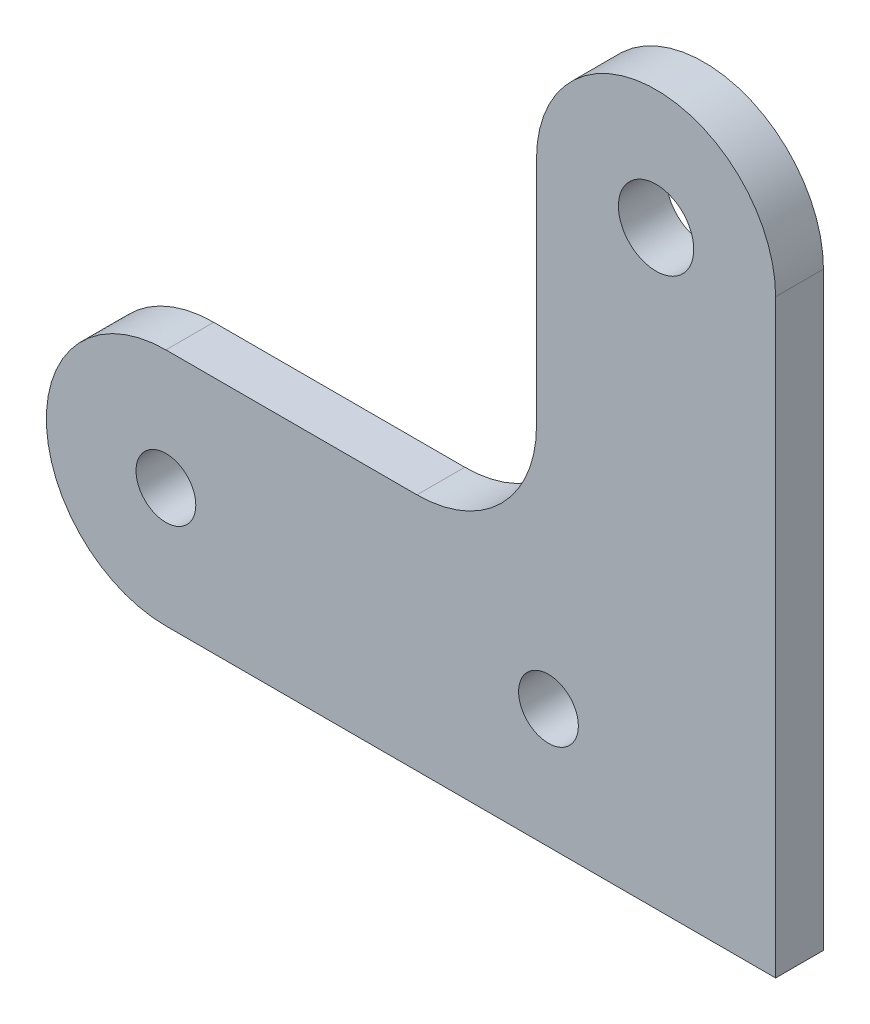
ISO-10303-21;
HEADER;
FILE_DESCRIPTION(('STEP AP214'),'2;1');
FILE_NAME('part.step','',(''),(''),'','','');
FILE_SCHEMA(('AUTOMOTIVE_DESIGN { 1 0 10303 214 1 1 1 1 }'));
ENDSEC;
DATA;
#1=APPLICATION_CONTEXT('core data for automotive mechanical design processes');
#2=APPLICATION_PROTOCOL_DEFINITION('international standard','automotive_design',2000,#1);
#3=PRODUCT_CONTEXT('',#1,'mechanical');
#4=PRODUCT('Part','Part','',(#3));
#5=PRODUCT_RELATED_PRODUCT_CATEGORY('part','',(#4));
#6=PRODUCT_DEFINITION_FORMATION('','',#4);
#7=PRODUCT_DEFINITION_CONTEXT('part definition',#1,'design');
#8=PRODUCT_DEFINITION('design','',#6,#7);
#9=PRODUCT_DEFINITION_SHAPE('','',#8);
#10=(LENGTH_UNIT() NAMED_UNIT(*) SI_UNIT(.MILLI.,.METRE.));
#11=(NAMED_UNIT(*) PLANE_ANGLE_UNIT() SI_UNIT($,.RADIAN.));
#12=(NAMED_UNIT(*) SI_UNIT($,.STERADIAN.) SOLID_ANGLE_UNIT());
#13=UNCERTAINTY_MEASURE_WITH_UNIT(LENGTH_MEASURE(1.E-05),#10,'distance_accuracy_value','');
#14=(GEOMETRIC_REPRESENTATION_CONTEXT(3) GLOBAL_UNCERTAINTY_ASSIGNED_CONTEXT((#13)) GLOBAL_UNIT_ASSIGNED_CONTEXT((#10,
#11,#12)) REPRESENTATION_CONTEXT('',''));
#15=CARTESIAN_POINT('',(0.,0.,0.));
#16=DIRECTION('',(0.,0.,1.));
#17=DIRECTION('',(1.,0.,0.));
#18=AXIS2_PLACEMENT_3D('',#15,#16,#17);
#19=CARTESIAN_POINT('',(-11.,20.,4.));
#20=DIRECTION('',(0.,0.,-1.));
#21=DIRECTION('',(-1.,0.,0.));
#22=AXIS2_PLACEMENT_3D('',#19,#20,#21);
#23=CYLINDRICAL_SURFACE('',#22,10.);
#24=CARTESIAN_POINT('',(-11.,20.,0.));
#25=DIRECTION('',(0.,0.,1.));
#26=DIRECTION('',(1.,0.,0.));
#27=AXIS2_PLACEMENT_3D('',#24,#25,#26);
#28=CIRCLE('',#27,10.);
#29=CARTESIAN_POINT('',(-11.0000000000001,10.,0.));
#30=VERTEX_POINT('',#29);
#31=CARTESIAN_POINT('',(-1.00000000000001,20.0000000000001,0.));
#32=VERTEX_POINT('',#31);
#33=EDGE_CURVE('E147',#30,#32,#28,.T.);
#34=ORIENTED_EDGE('',*,*,#33,.F.);
#35=DIRECTION('',(0.,0.,-1.));
#36=VECTOR('',#35,1.);
#37=CARTESIAN_POINT('',(-11.0000000000001,10.,4.));
#38=LINE('',#37,#36);
#39=CARTESIAN_POINT('',(-11.0000000000001,10.,4.));
#40=VERTEX_POINT('',#39);
#41=EDGE_CURVE('E11',#40,#30,#38,.T.);
#42=ORIENTED_EDGE('',*,*,#41,.F.);
#43=CARTESIAN_POINT('',(-11.,20.,4.));
#44=DIRECTION('',(0.,0.,1.));
#45=DIRECTION('',(1.,0.,0.));
#46=AXIS2_PLACEMENT_3D('',#43,#44,#45);
#47=CIRCLE('',#46,10.);
#48=CARTESIAN_POINT('',(-1.00000000000001,20.0000000000001,4.));
#49=VERTEX_POINT('',#48);
#50=EDGE_CURVE('E181',#40,#49,#47,.T.);
#51=ORIENTED_EDGE('',*,*,#50,.T.);
#52=DIRECTION('',(0.,0.,-1.));
#53=VECTOR('',#52,1.);
#54=CARTESIAN_POINT('',(-1.00000000000001,20.0000000000001,4.));
#55=LINE('',#54,#53);
#56=EDGE_CURVE('E89',#49,#32,#55,.T.);
#57=ORIENTED_EDGE('',*,*,#56,.T.);
#58=EDGE_LOOP('',(#34,#42,#51,#57));
#59=FACE_BOUND('',#58,.T.);
#60=ADVANCED_FACE('F41',(#59),#23,.F.);
#61=CARTESIAN_POINT('',(0.,10.,4.));
#62=DIRECTION('',(0.,1.,0.));
#63=DIRECTION('',(-1.,0.,0.));
#64=AXIS2_PLACEMENT_3D('',#61,#62,#63);
#65=PLANE('',#64);
#66=DIRECTION('',(1.,0.,0.));
#67=VECTOR('',#66,1.);
#68=CARTESIAN_POINT('',(0.,10.,0.));
#69=LINE('',#68,#67);
#70=CARTESIAN_POINT('',(-32.,10.,0.));
#71=VERTEX_POINT('',#70);
#72=EDGE_CURVE('E151',#71,#30,#69,.T.);
#73=ORIENTED_EDGE('',*,*,#72,.F.);
#74=DIRECTION('',(0.,0.,-1.));
#75=VECTOR('',#74,1.);
#76=CARTESIAN_POINT('',(-32.,10.,4.));
#77=LINE('',#76,#75);
#78=CARTESIAN_POINT('',(-32.,10.,4.));
#79=VERTEX_POINT('',#78);
#80=EDGE_CURVE('E50',#79,#71,#77,.T.);
#81=ORIENTED_EDGE('',*,*,#80,.F.);
#82=DIRECTION('',(1.,0.,0.));
#83=VECTOR('',#82,1.);
#84=CARTESIAN_POINT('',(0.,10.,4.));
#85=LINE('',#84,#83);
#86=EDGE_CURVE('E206',#79,#40,#85,.T.);
#87=ORIENTED_EDGE('',*,*,#86,.T.);
#88=ORIENTED_EDGE('',*,*,#41,.T.);
#89=EDGE_LOOP('',(#73,#81,#87,#88));
#90=FACE_BOUND('',#89,.T.);
#91=ADVANCED_FACE('F205',(#90),#65,.T.);
#92=CARTESIAN_POINT('',(-32.,0.,4.));
#93=DIRECTION('',(0.,0.,-1.));
#94=DIRECTION('',(-1.,0.,0.));
#95=AXIS2_PLACEMENT_3D('',#92,#93,#94);
#96=CYLINDRICAL_SURFACE('',#95,10.);
#97=CARTESIAN_POINT('',(-32.,0.,0.));
#98=DIRECTION('',(0.,0.,1.));
#99=DIRECTION('',(1.,0.,0.));
#100=AXIS2_PLACEMENT_3D('',#97,#98,#99);
#101=CIRCLE('',#100,10.);
#102=CARTESIAN_POINT('',(-32.,-10.,0.));
#103=VERTEX_POINT('',#102);
#104=EDGE_CURVE('E155',#71,#103,#101,.T.);
#105=ORIENTED_EDGE('',*,*,#104,.T.);
#106=DIRECTION('',(0.,0.,-1.));
#107=VECTOR('',#106,1.);
#108=CARTESIAN_POINT('',(-32.,-10.,4.));
#109=LINE('',#108,#107);
#110=CARTESIAN_POINT('',(-32.,-10.,4.));
#111=VERTEX_POINT('',#110);
#112=EDGE_CURVE('E188',#111,#103,#109,.T.);
#113=ORIENTED_EDGE('',*,*,#112,.F.);
#114=CARTESIAN_POINT('',(-32.,0.,4.));
#115=DIRECTION('',(0.,0.,1.));
#116=DIRECTION('',(1.,0.,0.));
#117=AXIS2_PLACEMENT_3D('',#114,#115,#116);
#118=CIRCLE('',#117,10.);
#119=EDGE_CURVE('E129',#79,#111,#118,.T.);
#120=ORIENTED_EDGE('',*,*,#119,.F.);
#121=ORIENTED_EDGE('',*,*,#80,.T.);
#122=EDGE_LOOP('',(#105,#113,#120,#121));
#123=FACE_BOUND('',#122,.T.);
#124=ADVANCED_FACE('F195',(#123),#96,.T.);
#125=CARTESIAN_POINT('',(0.,-10.,4.));
#126=DIRECTION('',(0.,1.,0.));
#127=DIRECTION('',(0.,0.,1.));
#128=AXIS2_PLACEMENT_3D('',#125,#126,#127);
#129=PLANE('',#128);
#130=DIRECTION('',(1.,0.,0.));
#131=VECTOR('',#130,1.);
#132=CARTESIAN_POINT('',(0.,-10.,0.));
#133=LINE('',#132,#131);
#134=CARTESIAN_POINT('',(19.,-10.,0.));
#135=VERTEX_POINT('',#134);
#136=EDGE_CURVE('E158',#103,#135,#133,.T.);
#137=ORIENTED_EDGE('',*,*,#136,.T.);
#138=DIRECTION('',(0.,0.,-1.));
#139=VECTOR('',#138,1.);
#140=CARTESIAN_POINT('',(19.,-10.,4.));
#141=LINE('',#140,#139);
#142=CARTESIAN_POINT('',(19.,-10.,4.));
#143=VERTEX_POINT('',#142);
#144=EDGE_CURVE('E114',#143,#135,#141,.T.);
#145=ORIENTED_EDGE('',*,*,#144,.F.);
#146=DIRECTION('',(1.,0.,0.));
#147=VECTOR('',#146,1.);
#148=CARTESIAN_POINT('',(0.,-10.,4.));
#149=LINE('',#148,#147);
#150=EDGE_CURVE('E124',#111,#143,#149,.T.);
#151=ORIENTED_EDGE('',*,*,#150,.F.);
#152=ORIENTED_EDGE('',*,*,#112,.T.);
#153=EDGE_LOOP('',(#137,#145,#151,#152));
#154=FACE_BOUND('',#153,.T.);
#155=ADVANCED_FACE('F216',(#154),#129,.F.);
#156=CARTESIAN_POINT('',(19.,0.,4.));
#157=DIRECTION('',(1.,0.,0.));
#158=DIRECTION('',(0.,0.,-1.));
#159=AXIS2_PLACEMENT_3D('',#156,#157,#158);
#160=PLANE('',#159);
#161=DIRECTION('',(0.,-1.,0.));
#162=VECTOR('',#161,1.);
#163=CARTESIAN_POINT('',(19.,0.,0.));
#164=LINE('',#163,#162);
#165=CARTESIAN_POINT('',(19.,39.35,0.));
#166=VERTEX_POINT('',#165);
#167=EDGE_CURVE('E112',#166,#135,#164,.T.);
#168=ORIENTED_EDGE('',*,*,#167,.F.);
#169=DIRECTION('',(0.,0.,-1.));
#170=VECTOR('',#169,1.);
#171=CARTESIAN_POINT('',(19.,39.35,4.));
#172=LINE('',#171,#170);
#173=CARTESIAN_POINT('',(19.,39.35,4.));
#174=VERTEX_POINT('',#173);
#175=EDGE_CURVE('E106',#174,#166,#172,.T.);
#176=ORIENTED_EDGE('',*,*,#175,.F.);
#177=DIRECTION('',(0.,-1.,0.));
#178=VECTOR('',#177,1.);
#179=CARTESIAN_POINT('',(19.,0.,4.));
#180=LINE('',#179,#178);
#181=EDGE_CURVE('E110',#174,#143,#180,.T.);
#182=ORIENTED_EDGE('',*,*,#181,.T.);
#183=ORIENTED_EDGE('',*,*,#144,.T.);
#184=EDGE_LOOP('',(#168,#176,#182,#183));
#185=FACE_BOUND('',#184,.T.);
#186=ADVANCED_FACE('F108',(#185),#160,.T.);
#187=CARTESIAN_POINT('',(9.,39.35,4.));
#188=DIRECTION('',(0.,0.,-1.));
#189=DIRECTION('',(-1.,0.,0.));
#190=AXIS2_PLACEMENT_3D('',#187,#188,#189);
#191=CYLINDRICAL_SURFACE('',#190,10.);
#192=CARTESIAN_POINT('',(9.,39.35,0.));
#193=DIRECTION('',(0.,0.,1.));
#194=DIRECTION('',(1.,0.,0.));
#195=AXIS2_PLACEMENT_3D('',#192,#193,#194);
#196=CIRCLE('',#195,10.);
#197=CARTESIAN_POINT('',(-1.,39.35,0.));
#198=VERTEX_POINT('',#197);
#199=EDGE_CURVE('E82',#166,#198,#196,.T.);
#200=ORIENTED_EDGE('',*,*,#199,.T.);
#201=DIRECTION('',(0.,0.,-1.));
#202=VECTOR('',#201,1.);
#203=CARTESIAN_POINT('',(-1.,39.35,4.));
#204=LINE('',#203,#202);
#205=CARTESIAN_POINT('',(-1.,39.35,4.));
#206=VERTEX_POINT('',#205);
#207=EDGE_CURVE('E115',#206,#198,#204,.T.);
#208=ORIENTED_EDGE('',*,*,#207,.F.);
#209=CARTESIAN_POINT('',(9.,39.35,4.));
#210=DIRECTION('',(0.,0.,1.));
#211=DIRECTION('',(1.,0.,0.));
#212=AXIS2_PLACEMENT_3D('',#209,#210,#211);
#213=CIRCLE('',#212,10.);
#214=EDGE_CURVE('E117',#174,#206,#213,.T.);
#215=ORIENTED_EDGE('',*,*,#214,.F.);
#216=ORIENTED_EDGE('',*,*,#175,.T.);
#217=EDGE_LOOP('',(#200,#208,#215,#216));
#218=FACE_BOUND('',#217,.T.);
#219=ADVANCED_FACE('F118',(#218),#191,.T.);
#220=CARTESIAN_POINT('',(9.,39.35,4.));
#221=DIRECTION('',(0.,0.,-1.));
#222=DIRECTION('',(-1.,0.,0.));
#223=AXIS2_PLACEMENT_3D('',#220,#221,#222);
#224=CYLINDRICAL_SURFACE('',#223,3.15);
#225=CARTESIAN_POINT('',(9.,39.35,4.));
#226=DIRECTION('',(0.,0.,1.));
#227=DIRECTION('',(1.,0.,0.));
#228=AXIS2_PLACEMENT_3D('',#225,#226,#227);
#229=CIRCLE('',#228,3.15);
#230=CARTESIAN_POINT('',(12.15,39.35,4.));
#231=VERTEX_POINT('',#230);
#232=EDGE_CURVE('E139',#231,#231,#229,.T.);
#233=ORIENTED_EDGE('',*,*,#232,.T.);
#234=EDGE_LOOP('',(#233));
#235=FACE_BOUND('',#234,.T.);
#236=CARTESIAN_POINT('',(9.,39.35,0.));
#237=DIRECTION('',(0.,0.,1.));
#238=DIRECTION('',(1.,0.,0.));
#239=AXIS2_PLACEMENT_3D('',#236,#237,#238);
#240=CIRCLE('',#239,3.15);
#241=CARTESIAN_POINT('',(12.15,39.35,0.));
#242=VERTEX_POINT('',#241);
#243=EDGE_CURVE('E173',#242,#242,#240,.T.);
#244=ORIENTED_EDGE('',*,*,#243,.F.);
#245=EDGE_LOOP('',(#244));
#246=FACE_BOUND('',#245,.T.);
#247=ADVANCED_FACE('F255',(#235,#246),#224,.F.);
#248=CARTESIAN_POINT('',(-32.,0.,4.));
#249=DIRECTION('',(0.,0.,-1.));
#250=DIRECTION('',(-1.,0.,0.));
#251=AXIS2_PLACEMENT_3D('',#248,#249,#250);
#252=CYLINDRICAL_SURFACE('',#251,2.49999999999999);
#253=CARTESIAN_POINT('',(-32.,0.,4.));
#254=DIRECTION('',(0.,0.,1.));
#255=DIRECTION('',(1.,0.,0.));
#256=AXIS2_PLACEMENT_3D('',#253,#254,#255);
#257=CIRCLE('',#256,2.49999999999999);
#258=CARTESIAN_POINT('',(-29.5,0.,4.));
#259=VERTEX_POINT('',#258);
#260=EDGE_CURVE('E135',#259,#259,#257,.T.);
#261=ORIENTED_EDGE('',*,*,#260,.T.);
#262=EDGE_LOOP('',(#261));
#263=FACE_BOUND('',#262,.T.);
#264=CARTESIAN_POINT('',(-32.,0.,0.));
#265=DIRECTION('',(0.,0.,1.));
#266=DIRECTION('',(1.,0.,0.));
#267=AXIS2_PLACEMENT_3D('',#264,#265,#266);
#268=CIRCLE('',#267,2.49999999999999);
#269=CARTESIAN_POINT('',(-29.5,0.,0.));
#270=VERTEX_POINT('',#269);
#271=EDGE_CURVE('E169',#270,#270,#268,.T.);
#272=ORIENTED_EDGE('',*,*,#271,.F.);
#273=EDGE_LOOP('',(#272));
#274=FACE_BOUND('',#273,.T.);
#275=ADVANCED_FACE('F264',(#263,#274),#252,.F.);
#276=CARTESIAN_POINT('',(-1.00000000000001,0.,4.));
#277=DIRECTION('',(1.,0.,0.));
#278=DIRECTION('',(0.,1.,0.));
#279=AXIS2_PLACEMENT_3D('',#276,#277,#278);
#280=PLANE('',#279);
#281=DIRECTION('',(0.,-1.,0.));
#282=VECTOR('',#281,1.);
#283=CARTESIAN_POINT('',(-1.00000000000001,0.,0.));
#284=LINE('',#283,#282);
#285=EDGE_CURVE('E166',#198,#32,#284,.T.);
#286=ORIENTED_EDGE('',*,*,#285,.T.);
#287=ORIENTED_EDGE('',*,*,#56,.F.);
#288=DIRECTION('',(0.,-1.,0.));
#289=VECTOR('',#288,1.);
#290=CARTESIAN_POINT('',(-1.00000000000001,0.,4.));
#291=LINE('',#290,#289);
#292=EDGE_CURVE('E58',#206,#49,#291,.T.);
#293=ORIENTED_EDGE('',*,*,#292,.F.);
#294=ORIENTED_EDGE('',*,*,#207,.T.);
#295=EDGE_LOOP('',(#286,#287,#293,#294));
#296=FACE_BOUND('',#295,.T.);
#297=ADVANCED_FACE('F209',(#296),#280,.F.);
#298=CARTESIAN_POINT('',(0.,0.,4.));
#299=DIRECTION('',(0.,0.,-1.));
#300=DIRECTION('',(-1.,0.,0.));
#301=AXIS2_PLACEMENT_3D('',#298,#299,#300);
#302=CYLINDRICAL_SURFACE('',#301,2.5);
#303=CARTESIAN_POINT('',(0.,0.,4.));
#304=DIRECTION('',(0.,0.,1.));
#305=DIRECTION('',(1.,0.,0.));
#306=AXIS2_PLACEMENT_3D('',#303,#304,#305);
#307=CIRCLE('',#306,2.5);
#308=CARTESIAN_POINT('',(2.5,0.,4.));
#309=VERTEX_POINT('',#308);
#310=EDGE_CURVE('E143',#309,#309,#307,.T.);
#311=ORIENTED_EDGE('',*,*,#310,.T.);
#312=EDGE_LOOP('',(#311));
#313=FACE_BOUND('',#312,.T.);
#314=CARTESIAN_POINT('',(0.,0.,0.));
#315=DIRECTION('',(0.,0.,1.));
#316=DIRECTION('',(1.,0.,0.));
#317=AXIS2_PLACEMENT_3D('',#314,#315,#316);
#318=CIRCLE('',#317,2.5);
#319=CARTESIAN_POINT('',(2.5,0.,0.));
#320=VERTEX_POINT('',#319);
#321=EDGE_CURVE('E177',#320,#320,#318,.T.);
#322=ORIENTED_EDGE('',*,*,#321,.F.);
#323=EDGE_LOOP('',(#322));
#324=FACE_BOUND('',#323,.T.);
#325=ADVANCED_FACE('F283',(#313,#324),#302,.F.);
#326=CARTESIAN_POINT('',(0.,0.,4.));
#327=DIRECTION('',(0.,0.,1.));
#328=DIRECTION('',(1.,0.,0.));
#329=AXIS2_PLACEMENT_3D('',#326,#327,#328);
#330=PLANE('',#329);
#331=ORIENTED_EDGE('',*,*,#50,.F.);
#332=ORIENTED_EDGE('',*,*,#86,.F.);
#333=ORIENTED_EDGE('',*,*,#119,.T.);
#334=ORIENTED_EDGE('',*,*,#150,.T.);
#335=ORIENTED_EDGE('',*,*,#181,.F.);
#336=ORIENTED_EDGE('',*,*,#214,.T.);
#337=ORIENTED_EDGE('',*,*,#292,.T.);
#338=EDGE_LOOP('',(#331,#332,#333,#334,#335,#336,#337));
#339=FACE_BOUND('',#338,.T.);
#340=ORIENTED_EDGE('',*,*,#260,.F.);
#341=EDGE_LOOP('',(#340));
#342=FACE_BOUND('',#341,.T.);
#343=ORIENTED_EDGE('',*,*,#232,.F.);
#344=EDGE_LOOP('',(#343));
#345=FACE_BOUND('',#344,.T.);
#346=ORIENTED_EDGE('',*,*,#310,.F.);
#347=EDGE_LOOP('',(#346));
#348=FACE_BOUND('',#347,.T.);
#349=ADVANCED_FACE('F121',(#339,#342,#345,#348),#330,.T.);
#350=CARTESIAN_POINT('',(0.,0.,0.));
#351=DIRECTION('',(0.,0.,1.));
#352=DIRECTION('',(1.,0.,0.));
#353=AXIS2_PLACEMENT_3D('',#350,#351,#352);
#354=PLANE('',#353);
#355=ORIENTED_EDGE('',*,*,#33,.T.);
#356=ORIENTED_EDGE('',*,*,#285,.F.);
#357=ORIENTED_EDGE('',*,*,#199,.F.);
#358=ORIENTED_EDGE('',*,*,#167,.T.);
#359=ORIENTED_EDGE('',*,*,#136,.F.);
#360=ORIENTED_EDGE('',*,*,#104,.F.);
#361=ORIENTED_EDGE('',*,*,#72,.T.);
#362=EDGE_LOOP('',(#355,#356,#357,#358,#359,#360,#361));
#363=FACE_BOUND('',#362,.T.);
#364=ORIENTED_EDGE('',*,*,#271,.T.);
#365=EDGE_LOOP('',(#364));
#366=FACE_BOUND('',#365,.T.);
#367=ORIENTED_EDGE('',*,*,#243,.T.);
#368=EDGE_LOOP('',(#367));
#369=FACE_BOUND('',#368,.T.);
#370=ORIENTED_EDGE('',*,*,#321,.T.);
#371=EDGE_LOOP('',(#370));
#372=FACE_BOUND('',#371,.T.);
#373=ADVANCED_FACE('F203',(#363,#366,#369,#372),#354,.F.);
#374=CLOSED_SHELL('',(#60,#91,#124,#155,#186,#219,#247,#275,#297,#325,#349,#373));
#375=MANIFOLD_SOLID_BREP('B2',#374);
#376=ADVANCED_BREP_SHAPE_REPRESENTATION('',(#18,#375),#14);
#377=SHAPE_DEFINITION_REPRESENTATION(#9,#376);
ENDSEC;
END-ISO-10303-21;
